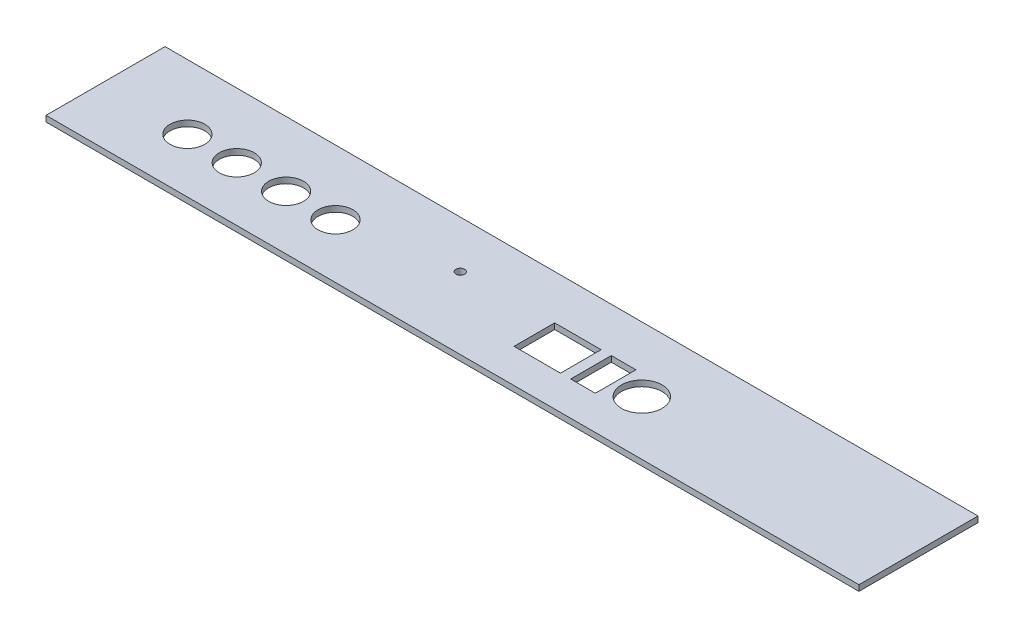
ISO-10303-21;
HEADER;
FILE_DESCRIPTION(('STEP AP214'),'2;1');
FILE_NAME('part.step','',(''),(''),'','','');
FILE_SCHEMA(('AUTOMOTIVE_DESIGN { 1 0 10303 214 1 1 1 1 }'));
ENDSEC;
DATA;
#1=APPLICATION_CONTEXT('core data for automotive mechanical design processes');
#2=APPLICATION_PROTOCOL_DEFINITION('international standard','automotive_design',2000,#1);
#3=PRODUCT_CONTEXT('',#1,'mechanical');
#4=PRODUCT('Part','Part','',(#3));
#5=PRODUCT_RELATED_PRODUCT_CATEGORY('part','',(#4));
#6=PRODUCT_DEFINITION_FORMATION('','',#4);
#7=PRODUCT_DEFINITION_CONTEXT('part definition',#1,'design');
#8=PRODUCT_DEFINITION('design','',#6,#7);
#9=PRODUCT_DEFINITION_SHAPE('','',#8);
#10=(LENGTH_UNIT() NAMED_UNIT(*) SI_UNIT(.MILLI.,.METRE.));
#11=(NAMED_UNIT(*) PLANE_ANGLE_UNIT() SI_UNIT($,.RADIAN.));
#12=(NAMED_UNIT(*) SI_UNIT($,.STERADIAN.) SOLID_ANGLE_UNIT());
#13=UNCERTAINTY_MEASURE_WITH_UNIT(LENGTH_MEASURE(1.E-05),#10,'distance_accuracy_value','');
#14=(GEOMETRIC_REPRESENTATION_CONTEXT(3) GLOBAL_UNCERTAINTY_ASSIGNED_CONTEXT((#13)) GLOBAL_UNIT_ASSIGNED_CONTEXT((#10,
#11,#12)) REPRESENTATION_CONTEXT('',''));
#15=CARTESIAN_POINT('',(0.,0.,0.));
#16=DIRECTION('',(0.,0.,1.));
#17=DIRECTION('',(1.,0.,0.));
#18=AXIS2_PLACEMENT_3D('',#15,#16,#17);
#19=CARTESIAN_POINT('',(0.,2.,0.));
#20=DIRECTION('',(0.,-1.,0.));
#21=DIRECTION('',(0.,0.,-1.));
#22=AXIS2_PLACEMENT_3D('',#19,#20,#21);
#23=PLANE('',#22);
#24=CARTESIAN_POINT('',(186.5,2.,-18.7));
#25=DIRECTION('',(0.,1.,0.));
#26=DIRECTION('',(0.,0.,1.));
#27=AXIS2_PLACEMENT_3D('',#24,#25,#26);
#28=CIRCLE('',#27,7.00000000000001);
#29=CARTESIAN_POINT('',(186.5,2.,-11.7));
#30=VERTEX_POINT('',#29);
#31=EDGE_CURVE('E153',#30,#30,#28,.T.);
#32=ORIENTED_EDGE('',*,*,#31,.F.);
#33=EDGE_LOOP('',(#32));
#34=FACE_BOUND('',#33,.T.);
#35=CARTESIAN_POINT('',(81.,2.,-18.7));
#36=DIRECTION('',(0.,1.,0.));
#37=DIRECTION('',(0.,0.,1.));
#38=AXIS2_PLACEMENT_3D('',#35,#36,#37);
#39=CIRCLE('',#38,6.);
#40=CARTESIAN_POINT('',(81.,2.,-12.7));
#41=VERTEX_POINT('',#40);
#42=EDGE_CURVE('E163',#41,#41,#39,.T.);
#43=ORIENTED_EDGE('',*,*,#42,.F.);
#44=EDGE_LOOP('',(#43));
#45=FACE_BOUND('',#44,.T.);
#46=CARTESIAN_POINT('',(47.,2.,-18.7));
#47=DIRECTION('',(0.,1.,0.));
#48=DIRECTION('',(0.,0.,1.));
#49=AXIS2_PLACEMENT_3D('',#46,#47,#48);
#50=CIRCLE('',#49,6.);
#51=CARTESIAN_POINT('',(47.,2.,-12.7));
#52=VERTEX_POINT('',#51);
#53=EDGE_CURVE('E175',#52,#52,#50,.T.);
#54=ORIENTED_EDGE('',*,*,#53,.F.);
#55=EDGE_LOOP('',(#54));
#56=FACE_BOUND('',#55,.T.);
#57=CARTESIAN_POINT('',(30.,2.,-18.7));
#58=DIRECTION('',(0.,1.,0.));
#59=DIRECTION('',(0.,0.,1.));
#60=AXIS2_PLACEMENT_3D('',#57,#58,#59);
#61=CIRCLE('',#60,6.);
#62=CARTESIAN_POINT('',(30.,2.,-12.7));
#63=VERTEX_POINT('',#62);
#64=EDGE_CURVE('E212',#63,#63,#61,.T.);
#65=ORIENTED_EDGE('',*,*,#64,.F.);
#66=EDGE_LOOP('',(#65));
#67=FACE_BOUND('',#66,.T.);
#68=DIRECTION('',(0.,0.,1.));
#69=VECTOR('',#68,1.);
#70=CARTESIAN_POINT('',(0.,2.,0.));
#71=LINE('',#70,#69);
#72=CARTESIAN_POINT('',(0.,2.,-41.));
#73=VERTEX_POINT('',#72);
#74=CARTESIAN_POINT('',(0.,2.,0.));
#75=VERTEX_POINT('',#74);
#76=EDGE_CURVE('E218',#73,#75,#71,.T.);
#77=ORIENTED_EDGE('',*,*,#76,.T.);
#78=DIRECTION('',(1.,0.,0.));
#79=VECTOR('',#78,1.);
#80=CARTESIAN_POINT('',(0.,2.,0.));
#81=LINE('',#80,#79);
#82=CARTESIAN_POINT('',(280.,2.,0.));
#83=VERTEX_POINT('',#82);
#84=EDGE_CURVE('E221',#75,#83,#81,.T.);
#85=ORIENTED_EDGE('',*,*,#84,.T.);
#86=DIRECTION('',(0.,0.,-1.));
#87=VECTOR('',#86,1.);
#88=CARTESIAN_POINT('',(280.,2.,0.));
#89=LINE('',#88,#87);
#90=CARTESIAN_POINT('',(280.,2.,-41.));
#91=VERTEX_POINT('',#90);
#92=EDGE_CURVE('E224',#83,#91,#89,.T.);
#93=ORIENTED_EDGE('',*,*,#92,.T.);
#94=DIRECTION('',(-1.,0.,0.));
#95=VECTOR('',#94,1.);
#96=CARTESIAN_POINT('',(0.,2.,-41.));
#97=LINE('',#96,#95);
#98=EDGE_CURVE('E226',#91,#73,#97,.T.);
#99=ORIENTED_EDGE('',*,*,#98,.T.);
#100=EDGE_LOOP('',(#77,#85,#93,#99));
#101=FACE_BOUND('',#100,.T.);
#102=DIRECTION('',(0.,0.,1.));
#103=VECTOR('',#102,1.);
#104=CARTESIAN_POINT('',(149.5,2.,-11.7));
#105=LINE('',#104,#103);
#106=CARTESIAN_POINT('',(149.5,2.,-25.7));
#107=VERTEX_POINT('',#106);
#108=CARTESIAN_POINT('',(149.5,2.,-11.7));
#109=VERTEX_POINT('',#108);
#110=EDGE_CURVE('E181',#107,#109,#105,.T.);
#111=ORIENTED_EDGE('',*,*,#110,.F.);
#112=DIRECTION('',(-1.,0.,0.));
#113=VECTOR('',#112,1.);
#114=CARTESIAN_POINT('',(149.5,2.,-25.7));
#115=LINE('',#114,#113);
#116=CARTESIAN_POINT('',(165.5,2.,-25.7));
#117=VERTEX_POINT('',#116);
#118=EDGE_CURVE('E189',#117,#107,#115,.T.);
#119=ORIENTED_EDGE('',*,*,#118,.F.);
#120=DIRECTION('',(0.,0.,-1.));
#121=VECTOR('',#120,1.);
#122=CARTESIAN_POINT('',(165.5,2.,-11.7));
#123=LINE('',#122,#121);
#124=CARTESIAN_POINT('',(165.5,2.,-11.7));
#125=VERTEX_POINT('',#124);
#126=EDGE_CURVE('E186',#125,#117,#123,.T.);
#127=ORIENTED_EDGE('',*,*,#126,.F.);
#128=DIRECTION('',(1.,0.,0.));
#129=VECTOR('',#128,1.);
#130=CARTESIAN_POINT('',(149.5,2.,-11.7));
#131=LINE('',#130,#129);
#132=EDGE_CURVE('E183',#109,#125,#131,.T.);
#133=ORIENTED_EDGE('',*,*,#132,.F.);
#134=EDGE_LOOP('',(#111,#119,#127,#133));
#135=FACE_BOUND('',#134,.T.);
#136=CARTESIAN_POINT('',(64.,2.,-18.7));
#137=DIRECTION('',(0.,1.,0.));
#138=DIRECTION('',(0.,0.,1.));
#139=AXIS2_PLACEMENT_3D('',#136,#137,#138);
#140=CIRCLE('',#139,6.);
#141=CARTESIAN_POINT('',(64.,2.,-12.7));
#142=VERTEX_POINT('',#141);
#143=EDGE_CURVE('E169',#142,#142,#140,.T.);
#144=ORIENTED_EDGE('',*,*,#143,.F.);
#145=EDGE_LOOP('',(#144));
#146=FACE_BOUND('',#145,.T.);
#147=DIRECTION('',(0.,0.,1.));
#148=VECTOR('',#147,1.);
#149=CARTESIAN_POINT('',(169.,2.,-11.7));
#150=LINE('',#149,#148);
#151=CARTESIAN_POINT('',(169.,2.,-25.7));
#152=VERTEX_POINT('',#151);
#153=CARTESIAN_POINT('',(169.,2.,-11.7));
#154=VERTEX_POINT('',#153);
#155=EDGE_CURVE('E124',#152,#154,#150,.T.);
#156=ORIENTED_EDGE('',*,*,#155,.F.);
#157=DIRECTION('',(-1.,0.,0.));
#158=VECTOR('',#157,1.);
#159=CARTESIAN_POINT('',(169.,2.,-25.7));
#160=LINE('',#159,#158);
#161=CARTESIAN_POINT('',(177.5,2.,-25.7));
#162=VERTEX_POINT('',#161);
#163=EDGE_CURVE('E147',#162,#152,#160,.T.);
#164=ORIENTED_EDGE('',*,*,#163,.F.);
#165=DIRECTION('',(0.,0.,-1.));
#166=VECTOR('',#165,1.);
#167=CARTESIAN_POINT('',(177.5,2.,-11.7));
#168=LINE('',#167,#166);
#169=CARTESIAN_POINT('',(177.5,2.,-11.7));
#170=VERTEX_POINT('',#169);
#171=EDGE_CURVE('E145',#170,#162,#168,.T.);
#172=ORIENTED_EDGE('',*,*,#171,.F.);
#173=DIRECTION('',(1.,0.,0.));
#174=VECTOR('',#173,1.);
#175=CARTESIAN_POINT('',(169.,2.,-11.7));
#176=LINE('',#175,#174);
#177=EDGE_CURVE('E132',#154,#170,#176,.T.);
#178=ORIENTED_EDGE('',*,*,#177,.F.);
#179=EDGE_LOOP('',(#156,#164,#172,#178));
#180=FACE_BOUND('',#179,.T.);
#181=CARTESIAN_POINT('',(118.,2.,-24.7));
#182=DIRECTION('',(0.,1.,0.));
#183=DIRECTION('',(0.,0.,1.));
#184=AXIS2_PLACEMENT_3D('',#181,#182,#183);
#185=CIRCLE('',#184,1.5);
#186=CARTESIAN_POINT('',(118.,2.,-23.2));
#187=VERTEX_POINT('',#186);
#188=EDGE_CURVE('E348',#187,#187,#185,.T.);
#189=ORIENTED_EDGE('',*,*,#188,.F.);
#190=EDGE_LOOP('',(#189));
#191=FACE_BOUND('',#190,.T.);
#192=ADVANCED_FACE('F35',(#34,#45,#56,#67,#101,#135,#146,#180,#191),#23,.F.);
#193=CARTESIAN_POINT('',(0.,0.,0.));
#194=DIRECTION('',(0.,-1.,0.));
#195=DIRECTION('',(0.,0.,-1.));
#196=AXIS2_PLACEMENT_3D('',#193,#194,#195);
#197=PLANE('',#196);
#198=CARTESIAN_POINT('',(186.5,0.,-18.7));
#199=DIRECTION('',(0.,1.,0.));
#200=DIRECTION('',(0.,0.,1.));
#201=AXIS2_PLACEMENT_3D('',#198,#199,#200);
#202=CIRCLE('',#201,7.00000000000001);
#203=CARTESIAN_POINT('',(186.5,0.,-11.7));
#204=VERTEX_POINT('',#203);
#205=EDGE_CURVE('E354',#204,#204,#202,.T.);
#206=ORIENTED_EDGE('',*,*,#205,.T.);
#207=EDGE_LOOP('',(#206));
#208=FACE_BOUND('',#207,.T.);
#209=CARTESIAN_POINT('',(81.,0.,-18.7));
#210=DIRECTION('',(0.,1.,0.));
#211=DIRECTION('',(0.,0.,1.));
#212=AXIS2_PLACEMENT_3D('',#209,#210,#211);
#213=CIRCLE('',#212,6.);
#214=CARTESIAN_POINT('',(81.,0.,-12.7));
#215=VERTEX_POINT('',#214);
#216=EDGE_CURVE('E140',#215,#215,#213,.T.);
#217=ORIENTED_EDGE('',*,*,#216,.T.);
#218=EDGE_LOOP('',(#217));
#219=FACE_BOUND('',#218,.T.);
#220=CARTESIAN_POINT('',(47.,0.,-18.7));
#221=DIRECTION('',(0.,1.,0.));
#222=DIRECTION('',(0.,0.,1.));
#223=AXIS2_PLACEMENT_3D('',#220,#221,#222);
#224=CIRCLE('',#223,6.);
#225=CARTESIAN_POINT('',(47.,0.,-12.7));
#226=VERTEX_POINT('',#225);
#227=EDGE_CURVE('E172',#226,#226,#224,.T.);
#228=ORIENTED_EDGE('',*,*,#227,.T.);
#229=EDGE_LOOP('',(#228));
#230=FACE_BOUND('',#229,.T.);
#231=CARTESIAN_POINT('',(30.,0.,-18.7));
#232=DIRECTION('',(0.,1.,0.));
#233=DIRECTION('',(0.,0.,1.));
#234=AXIS2_PLACEMENT_3D('',#231,#232,#233);
#235=CIRCLE('',#234,6.);
#236=CARTESIAN_POINT('',(30.,0.,-12.7));
#237=VERTEX_POINT('',#236);
#238=EDGE_CURVE('E211',#237,#237,#235,.T.);
#239=ORIENTED_EDGE('',*,*,#238,.T.);
#240=EDGE_LOOP('',(#239));
#241=FACE_BOUND('',#240,.T.);
#242=DIRECTION('',(0.,0.,1.));
#243=VECTOR('',#242,1.);
#244=CARTESIAN_POINT('',(0.,0.,0.));
#245=LINE('',#244,#243);
#246=CARTESIAN_POINT('',(0.,0.,-41.));
#247=VERTEX_POINT('',#246);
#248=CARTESIAN_POINT('',(0.,0.,0.));
#249=VERTEX_POINT('',#248);
#250=EDGE_CURVE('E215',#247,#249,#245,.T.);
#251=ORIENTED_EDGE('',*,*,#250,.F.);
#252=DIRECTION('',(-1.,0.,0.));
#253=VECTOR('',#252,1.);
#254=CARTESIAN_POINT('',(0.,0.,-41.));
#255=LINE('',#254,#253);
#256=CARTESIAN_POINT('',(280.,0.,-41.));
#257=VERTEX_POINT('',#256);
#258=EDGE_CURVE('E222',#257,#247,#255,.T.);
#259=ORIENTED_EDGE('',*,*,#258,.F.);
#260=DIRECTION('',(0.,0.,-1.));
#261=VECTOR('',#260,1.);
#262=CARTESIAN_POINT('',(280.,0.,0.));
#263=LINE('',#262,#261);
#264=CARTESIAN_POINT('',(280.,0.,0.));
#265=VERTEX_POINT('',#264);
#266=EDGE_CURVE('E233',#265,#257,#263,.T.);
#267=ORIENTED_EDGE('',*,*,#266,.F.);
#268=DIRECTION('',(1.,0.,0.));
#269=VECTOR('',#268,1.);
#270=CARTESIAN_POINT('',(0.,0.,0.));
#271=LINE('',#270,#269);
#272=EDGE_CURVE('E231',#249,#265,#271,.T.);
#273=ORIENTED_EDGE('',*,*,#272,.F.);
#274=EDGE_LOOP('',(#251,#259,#267,#273));
#275=FACE_BOUND('',#274,.T.);
#276=DIRECTION('',(-1.,0.,0.));
#277=VECTOR('',#276,1.);
#278=CARTESIAN_POINT('',(149.5,0.,-25.7));
#279=LINE('',#278,#277);
#280=CARTESIAN_POINT('',(165.5,0.,-25.7));
#281=VERTEX_POINT('',#280);
#282=CARTESIAN_POINT('',(149.5,0.,-25.7));
#283=VERTEX_POINT('',#282);
#284=EDGE_CURVE('E184',#281,#283,#279,.T.);
#285=ORIENTED_EDGE('',*,*,#284,.T.);
#286=DIRECTION('',(0.,0.,1.));
#287=VECTOR('',#286,1.);
#288=CARTESIAN_POINT('',(149.5,0.,-11.7));
#289=LINE('',#288,#287);
#290=CARTESIAN_POINT('',(149.5,0.,-11.7));
#291=VERTEX_POINT('',#290);
#292=EDGE_CURVE('E178',#283,#291,#289,.T.);
#293=ORIENTED_EDGE('',*,*,#292,.T.);
#294=DIRECTION('',(1.,0.,0.));
#295=VECTOR('',#294,1.);
#296=CARTESIAN_POINT('',(149.5,0.,-11.7));
#297=LINE('',#296,#295);
#298=CARTESIAN_POINT('',(165.5,0.,-11.7));
#299=VERTEX_POINT('',#298);
#300=EDGE_CURVE('E194',#291,#299,#297,.T.);
#301=ORIENTED_EDGE('',*,*,#300,.T.);
#302=DIRECTION('',(0.,0.,-1.));
#303=VECTOR('',#302,1.);
#304=CARTESIAN_POINT('',(165.5,0.,-11.7));
#305=LINE('',#304,#303);
#306=EDGE_CURVE('E197',#299,#281,#305,.T.);
#307=ORIENTED_EDGE('',*,*,#306,.T.);
#308=EDGE_LOOP('',(#285,#293,#301,#307));
#309=FACE_BOUND('',#308,.T.);
#310=CARTESIAN_POINT('',(64.,0.,-18.7));
#311=DIRECTION('',(0.,1.,0.));
#312=DIRECTION('',(0.,0.,1.));
#313=AXIS2_PLACEMENT_3D('',#310,#311,#312);
#314=CIRCLE('',#313,6.);
#315=CARTESIAN_POINT('',(64.,0.,-12.7));
#316=VERTEX_POINT('',#315);
#317=EDGE_CURVE('E166',#316,#316,#314,.T.);
#318=ORIENTED_EDGE('',*,*,#317,.T.);
#319=EDGE_LOOP('',(#318));
#320=FACE_BOUND('',#319,.T.);
#321=DIRECTION('',(-1.,0.,0.));
#322=VECTOR('',#321,1.);
#323=CARTESIAN_POINT('',(169.,0.,-25.7));
#324=LINE('',#323,#322);
#325=CARTESIAN_POINT('',(177.5,0.,-25.7));
#326=VERTEX_POINT('',#325);
#327=CARTESIAN_POINT('',(169.,0.,-25.7));
#328=VERTEX_POINT('',#327);
#329=EDGE_CURVE('E133',#326,#328,#324,.T.);
#330=ORIENTED_EDGE('',*,*,#329,.T.);
#331=DIRECTION('',(0.,0.,1.));
#332=VECTOR('',#331,1.);
#333=CARTESIAN_POINT('',(169.,0.,-11.7));
#334=LINE('',#333,#332);
#335=CARTESIAN_POINT('',(169.,0.,-11.7));
#336=VERTEX_POINT('',#335);
#337=EDGE_CURVE('E58',#328,#336,#334,.T.);
#338=ORIENTED_EDGE('',*,*,#337,.T.);
#339=DIRECTION('',(1.,0.,0.));
#340=VECTOR('',#339,1.);
#341=CARTESIAN_POINT('',(169.,0.,-11.7));
#342=LINE('',#341,#340);
#343=CARTESIAN_POINT('',(177.5,0.,-11.7));
#344=VERTEX_POINT('',#343);
#345=EDGE_CURVE('E139',#336,#344,#342,.T.);
#346=ORIENTED_EDGE('',*,*,#345,.T.);
#347=DIRECTION('',(0.,0.,-1.));
#348=VECTOR('',#347,1.);
#349=CARTESIAN_POINT('',(177.5,0.,-11.7));
#350=LINE('',#349,#348);
#351=EDGE_CURVE('E155',#344,#326,#350,.T.);
#352=ORIENTED_EDGE('',*,*,#351,.T.);
#353=EDGE_LOOP('',(#330,#338,#346,#352));
#354=FACE_BOUND('',#353,.T.);
#355=CARTESIAN_POINT('',(118.,0.,-24.7));
#356=DIRECTION('',(0.,1.,0.));
#357=DIRECTION('',(0.,0.,1.));
#358=AXIS2_PLACEMENT_3D('',#355,#356,#357);
#359=CIRCLE('',#358,1.5);
#360=CARTESIAN_POINT('',(118.,0.,-23.2));
#361=VERTEX_POINT('',#360);
#362=EDGE_CURVE('E351',#361,#361,#359,.T.);
#363=ORIENTED_EDGE('',*,*,#362,.T.);
#364=EDGE_LOOP('',(#363));
#365=FACE_BOUND('',#364,.T.);
#366=ADVANCED_FACE('F251',(#208,#219,#230,#241,#275,#309,#320,#354,#365),#197,.T.);
#367=CARTESIAN_POINT('',(0.,2.,0.));
#368=DIRECTION('',(1.,0.,0.));
#369=DIRECTION('',(0.,0.,-1.));
#370=AXIS2_PLACEMENT_3D('',#367,#368,#369);
#371=PLANE('',#370);
#372=ORIENTED_EDGE('',*,*,#250,.T.);
#373=DIRECTION('',(0.,-1.,0.));
#374=VECTOR('',#373,1.);
#375=CARTESIAN_POINT('',(0.,2.,0.));
#376=LINE('',#375,#374);
#377=EDGE_CURVE('E11',#75,#249,#376,.T.);
#378=ORIENTED_EDGE('',*,*,#377,.F.);
#379=ORIENTED_EDGE('',*,*,#76,.F.);
#380=DIRECTION('',(0.,-1.,0.));
#381=VECTOR('',#380,1.);
#382=CARTESIAN_POINT('',(0.,2.,-41.));
#383=LINE('',#382,#381);
#384=EDGE_CURVE('E228',#73,#247,#383,.T.);
#385=ORIENTED_EDGE('',*,*,#384,.T.);
#386=EDGE_LOOP('',(#372,#378,#379,#385));
#387=FACE_BOUND('',#386,.T.);
#388=ADVANCED_FACE('F37',(#387),#371,.F.);
#389=CARTESIAN_POINT('',(0.,2.,0.));
#390=DIRECTION('',(0.,0.,-1.));
#391=DIRECTION('',(-1.,0.,0.));
#392=AXIS2_PLACEMENT_3D('',#389,#390,#391);
#393=PLANE('',#392);
#394=ORIENTED_EDGE('',*,*,#272,.T.);
#395=DIRECTION('',(0.,-1.,0.));
#396=VECTOR('',#395,1.);
#397=CARTESIAN_POINT('',(280.,2.,0.));
#398=LINE('',#397,#396);
#399=EDGE_CURVE('E43',#83,#265,#398,.T.);
#400=ORIENTED_EDGE('',*,*,#399,.F.);
#401=ORIENTED_EDGE('',*,*,#84,.F.);
#402=ORIENTED_EDGE('',*,*,#377,.T.);
#403=EDGE_LOOP('',(#394,#400,#401,#402));
#404=FACE_BOUND('',#403,.T.);
#405=ADVANCED_FACE('F262',(#404),#393,.F.);
#406=CARTESIAN_POINT('',(280.,2.,0.));
#407=DIRECTION('',(-1.,0.,0.));
#408=DIRECTION('',(0.,0.,1.));
#409=AXIS2_PLACEMENT_3D('',#406,#407,#408);
#410=PLANE('',#409);
#411=ORIENTED_EDGE('',*,*,#266,.T.);
#412=DIRECTION('',(0.,-1.,0.));
#413=VECTOR('',#412,1.);
#414=CARTESIAN_POINT('',(280.,2.,-41.));
#415=LINE('',#414,#413);
#416=EDGE_CURVE('E238',#91,#257,#415,.T.);
#417=ORIENTED_EDGE('',*,*,#416,.F.);
#418=ORIENTED_EDGE('',*,*,#92,.F.);
#419=ORIENTED_EDGE('',*,*,#399,.T.);
#420=EDGE_LOOP('',(#411,#417,#418,#419));
#421=FACE_BOUND('',#420,.T.);
#422=ADVANCED_FACE('F245',(#421),#410,.F.);
#423=CARTESIAN_POINT('',(0.,2.,-41.));
#424=DIRECTION('',(0.,0.,1.));
#425=DIRECTION('',(1.,0.,0.));
#426=AXIS2_PLACEMENT_3D('',#423,#424,#425);
#427=PLANE('',#426);
#428=ORIENTED_EDGE('',*,*,#258,.T.);
#429=ORIENTED_EDGE('',*,*,#384,.F.);
#430=ORIENTED_EDGE('',*,*,#98,.F.);
#431=ORIENTED_EDGE('',*,*,#416,.T.);
#432=EDGE_LOOP('',(#428,#429,#430,#431));
#433=FACE_BOUND('',#432,.T.);
#434=ADVANCED_FACE('F255',(#433),#427,.F.);
#435=CARTESIAN_POINT('',(30.,2.,-18.7));
#436=DIRECTION('',(0.,-1.,0.));
#437=DIRECTION('',(0.,0.,-1.));
#438=AXIS2_PLACEMENT_3D('',#435,#436,#437);
#439=CYLINDRICAL_SURFACE('',#438,6.);
#440=ORIENTED_EDGE('',*,*,#64,.T.);
#441=EDGE_LOOP('',(#440));
#442=FACE_BOUND('',#441,.T.);
#443=ORIENTED_EDGE('',*,*,#238,.F.);
#444=EDGE_LOOP('',(#443));
#445=FACE_BOUND('',#444,.T.);
#446=ADVANCED_FACE('F280',(#442,#445),#439,.F.);
#447=CARTESIAN_POINT('',(149.5,2.,-11.7));
#448=DIRECTION('',(1.,0.,0.));
#449=DIRECTION('',(0.,0.,-1.));
#450=AXIS2_PLACEMENT_3D('',#447,#448,#449);
#451=PLANE('',#450);
#452=ORIENTED_EDGE('',*,*,#292,.F.);
#453=DIRECTION('',(0.,-1.,0.));
#454=VECTOR('',#453,1.);
#455=CARTESIAN_POINT('',(149.5,2.,-25.7));
#456=LINE('',#455,#454);
#457=EDGE_CURVE('E191',#107,#283,#456,.T.);
#458=ORIENTED_EDGE('',*,*,#457,.F.);
#459=ORIENTED_EDGE('',*,*,#110,.T.);
#460=DIRECTION('',(0.,-1.,0.));
#461=VECTOR('',#460,1.);
#462=CARTESIAN_POINT('',(149.5,2.,-11.7));
#463=LINE('',#462,#461);
#464=EDGE_CURVE('E208',#109,#291,#463,.T.);
#465=ORIENTED_EDGE('',*,*,#464,.T.);
#466=EDGE_LOOP('',(#452,#458,#459,#465));
#467=FACE_BOUND('',#466,.T.);
#468=ADVANCED_FACE('F287',(#467),#451,.T.);
#469=CARTESIAN_POINT('',(149.5,2.,-11.7));
#470=DIRECTION('',(0.,0.,-1.));
#471=DIRECTION('',(-1.,0.,0.));
#472=AXIS2_PLACEMENT_3D('',#469,#470,#471);
#473=PLANE('',#472);
#474=ORIENTED_EDGE('',*,*,#300,.F.);
#475=ORIENTED_EDGE('',*,*,#464,.F.);
#476=ORIENTED_EDGE('',*,*,#132,.T.);
#477=DIRECTION('',(0.,-1.,0.));
#478=VECTOR('',#477,1.);
#479=CARTESIAN_POINT('',(165.5,2.,-11.7));
#480=LINE('',#479,#478);
#481=EDGE_CURVE('E206',#125,#299,#480,.T.);
#482=ORIENTED_EDGE('',*,*,#481,.T.);
#483=EDGE_LOOP('',(#474,#475,#476,#482));
#484=FACE_BOUND('',#483,.T.);
#485=ADVANCED_FACE('F292',(#484),#473,.T.);
#486=CARTESIAN_POINT('',(165.5,2.,-11.7));
#487=DIRECTION('',(-1.,0.,0.));
#488=DIRECTION('',(0.,0.,1.));
#489=AXIS2_PLACEMENT_3D('',#486,#487,#488);
#490=PLANE('',#489);
#491=ORIENTED_EDGE('',*,*,#306,.F.);
#492=ORIENTED_EDGE('',*,*,#481,.F.);
#493=ORIENTED_EDGE('',*,*,#126,.T.);
#494=DIRECTION('',(0.,-1.,0.));
#495=VECTOR('',#494,1.);
#496=CARTESIAN_POINT('',(165.5,2.,-25.7));
#497=LINE('',#496,#495);
#498=EDGE_CURVE('E204',#117,#281,#497,.T.);
#499=ORIENTED_EDGE('',*,*,#498,.T.);
#500=EDGE_LOOP('',(#491,#492,#493,#499));
#501=FACE_BOUND('',#500,.T.);
#502=ADVANCED_FACE('F302',(#501),#490,.T.);
#503=CARTESIAN_POINT('',(149.5,2.,-25.7));
#504=DIRECTION('',(0.,0.,1.));
#505=DIRECTION('',(1.,0.,0.));
#506=AXIS2_PLACEMENT_3D('',#503,#504,#505);
#507=PLANE('',#506);
#508=ORIENTED_EDGE('',*,*,#284,.F.);
#509=ORIENTED_EDGE('',*,*,#498,.F.);
#510=ORIENTED_EDGE('',*,*,#118,.T.);
#511=ORIENTED_EDGE('',*,*,#457,.T.);
#512=EDGE_LOOP('',(#508,#509,#510,#511));
#513=FACE_BOUND('',#512,.T.);
#514=ADVANCED_FACE('F308',(#513),#507,.T.);
#515=CARTESIAN_POINT('',(47.,2.,-18.7));
#516=DIRECTION('',(0.,-1.,0.));
#517=DIRECTION('',(0.,0.,-1.));
#518=AXIS2_PLACEMENT_3D('',#515,#516,#517);
#519=CYLINDRICAL_SURFACE('',#518,6.);
#520=ORIENTED_EDGE('',*,*,#53,.T.);
#521=EDGE_LOOP('',(#520));
#522=FACE_BOUND('',#521,.T.);
#523=ORIENTED_EDGE('',*,*,#227,.F.);
#524=EDGE_LOOP('',(#523));
#525=FACE_BOUND('',#524,.T.);
#526=ADVANCED_FACE('F312',(#522,#525),#519,.F.);
#527=CARTESIAN_POINT('',(64.,2.,-18.7));
#528=DIRECTION('',(0.,-1.,0.));
#529=DIRECTION('',(0.,0.,-1.));
#530=AXIS2_PLACEMENT_3D('',#527,#528,#529);
#531=CYLINDRICAL_SURFACE('',#530,6.);
#532=ORIENTED_EDGE('',*,*,#143,.T.);
#533=EDGE_LOOP('',(#532));
#534=FACE_BOUND('',#533,.T.);
#535=ORIENTED_EDGE('',*,*,#317,.F.);
#536=EDGE_LOOP('',(#535));
#537=FACE_BOUND('',#536,.T.);
#538=ADVANCED_FACE('F316',(#534,#537),#531,.F.);
#539=CARTESIAN_POINT('',(81.,2.,-18.7));
#540=DIRECTION('',(0.,-1.,0.));
#541=DIRECTION('',(0.,0.,-1.));
#542=AXIS2_PLACEMENT_3D('',#539,#540,#541);
#543=CYLINDRICAL_SURFACE('',#542,6.);
#544=ORIENTED_EDGE('',*,*,#42,.T.);
#545=EDGE_LOOP('',(#544));
#546=FACE_BOUND('',#545,.T.);
#547=ORIENTED_EDGE('',*,*,#216,.F.);
#548=EDGE_LOOP('',(#547));
#549=FACE_BOUND('',#548,.T.);
#550=ADVANCED_FACE('F320',(#546,#549),#543,.F.);
#551=CARTESIAN_POINT('',(169.,2.,-11.7));
#552=DIRECTION('',(1.,0.,0.));
#553=DIRECTION('',(0.,0.,-1.));
#554=AXIS2_PLACEMENT_3D('',#551,#552,#553);
#555=PLANE('',#554);
#556=ORIENTED_EDGE('',*,*,#337,.F.);
#557=DIRECTION('',(0.,-1.,0.));
#558=VECTOR('',#557,1.);
#559=CARTESIAN_POINT('',(169.,2.,-25.7));
#560=LINE('',#559,#558);
#561=EDGE_CURVE('E128',#152,#328,#560,.T.);
#562=ORIENTED_EDGE('',*,*,#561,.F.);
#563=ORIENTED_EDGE('',*,*,#155,.T.);
#564=DIRECTION('',(0.,-1.,0.));
#565=VECTOR('',#564,1.);
#566=CARTESIAN_POINT('',(169.,2.,-11.7));
#567=LINE('',#566,#565);
#568=EDGE_CURVE('E127',#154,#336,#567,.T.);
#569=ORIENTED_EDGE('',*,*,#568,.T.);
#570=EDGE_LOOP('',(#556,#562,#563,#569));
#571=FACE_BOUND('',#570,.T.);
#572=ADVANCED_FACE('F126',(#571),#555,.T.);
#573=CARTESIAN_POINT('',(169.,2.,-11.7));
#574=DIRECTION('',(0.,0.,-1.));
#575=DIRECTION('',(-1.,0.,0.));
#576=AXIS2_PLACEMENT_3D('',#573,#574,#575);
#577=PLANE('',#576);
#578=ORIENTED_EDGE('',*,*,#345,.F.);
#579=ORIENTED_EDGE('',*,*,#568,.F.);
#580=ORIENTED_EDGE('',*,*,#177,.T.);
#581=DIRECTION('',(0.,-1.,0.));
#582=VECTOR('',#581,1.);
#583=CARTESIAN_POINT('',(177.5,2.,-11.7));
#584=LINE('',#583,#582);
#585=EDGE_CURVE('E141',#170,#344,#584,.T.);
#586=ORIENTED_EDGE('',*,*,#585,.T.);
#587=EDGE_LOOP('',(#578,#579,#580,#586));
#588=FACE_BOUND('',#587,.T.);
#589=ADVANCED_FACE('F136',(#588),#577,.T.);
#590=CARTESIAN_POINT('',(177.5,2.,-11.7));
#591=DIRECTION('',(-1.,0.,0.));
#592=DIRECTION('',(0.,0.,1.));
#593=AXIS2_PLACEMENT_3D('',#590,#591,#592);
#594=PLANE('',#593);
#595=ORIENTED_EDGE('',*,*,#351,.F.);
#596=ORIENTED_EDGE('',*,*,#585,.F.);
#597=ORIENTED_EDGE('',*,*,#171,.T.);
#598=DIRECTION('',(0.,-1.,0.));
#599=VECTOR('',#598,1.);
#600=CARTESIAN_POINT('',(177.5,2.,-25.7));
#601=LINE('',#600,#599);
#602=EDGE_CURVE('E50',#162,#326,#601,.T.);
#603=ORIENTED_EDGE('',*,*,#602,.T.);
#604=EDGE_LOOP('',(#595,#596,#597,#603));
#605=FACE_BOUND('',#604,.T.);
#606=ADVANCED_FACE('F329',(#605),#594,.T.);
#607=CARTESIAN_POINT('',(169.,2.,-25.7));
#608=DIRECTION('',(0.,0.,1.));
#609=DIRECTION('',(1.,0.,0.));
#610=AXIS2_PLACEMENT_3D('',#607,#608,#609);
#611=PLANE('',#610);
#612=ORIENTED_EDGE('',*,*,#329,.F.);
#613=ORIENTED_EDGE('',*,*,#602,.F.);
#614=ORIENTED_EDGE('',*,*,#163,.T.);
#615=ORIENTED_EDGE('',*,*,#561,.T.);
#616=EDGE_LOOP('',(#612,#613,#614,#615));
#617=FACE_BOUND('',#616,.T.);
#618=ADVANCED_FACE('F332',(#617),#611,.T.);
#619=CARTESIAN_POINT('',(186.5,2.,-18.7));
#620=DIRECTION('',(0.,-1.,0.));
#621=DIRECTION('',(0.,0.,-1.));
#622=AXIS2_PLACEMENT_3D('',#619,#620,#621);
#623=CYLINDRICAL_SURFACE('',#622,7.00000000000001);
#624=ORIENTED_EDGE('',*,*,#31,.T.);
#625=EDGE_LOOP('',(#624));
#626=FACE_BOUND('',#625,.T.);
#627=ORIENTED_EDGE('',*,*,#205,.F.);
#628=EDGE_LOOP('',(#627));
#629=FACE_BOUND('',#628,.T.);
#630=ADVANCED_FACE('F336',(#626,#629),#623,.F.);
#631=CARTESIAN_POINT('',(118.,2.,-24.7));
#632=DIRECTION('',(0.,-1.,0.));
#633=DIRECTION('',(0.,0.,-1.));
#634=AXIS2_PLACEMENT_3D('',#631,#632,#633);
#635=CYLINDRICAL_SURFACE('',#634,1.5);
#636=ORIENTED_EDGE('',*,*,#188,.T.);
#637=EDGE_LOOP('',(#636));
#638=FACE_BOUND('',#637,.T.);
#639=ORIENTED_EDGE('',*,*,#362,.F.);
#640=EDGE_LOOP('',(#639));
#641=FACE_BOUND('',#640,.T.);
#642=ADVANCED_FACE('F339',(#638,#641),#635,.F.);
#643=CLOSED_SHELL('',(#192,#366,#388,#405,#422,#434,#446,#468,#485,#502,#514,#526,#538,#550,
#572,#589,#606,#618,#630,#642));
#644=MANIFOLD_SOLID_BREP('B2',#643);
#645=ADVANCED_BREP_SHAPE_REPRESENTATION('',(#18,#644),#14);
#646=SHAPE_DEFINITION_REPRESENTATION(#9,#645);
ENDSEC;
END-ISO-10303-21;
